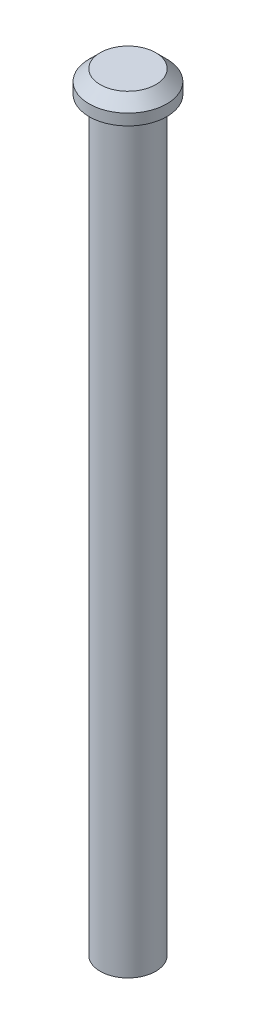
ISO-10303-21;
HEADER;
FILE_DESCRIPTION(('STEP AP214'),'2;1');
FILE_NAME('part.step','',(''),(''),'','','');
FILE_SCHEMA(('AUTOMOTIVE_DESIGN { 1 0 10303 214 1 1 1 1 }'));
ENDSEC;
DATA;
#1=APPLICATION_CONTEXT('core data for automotive mechanical design processes');
#2=APPLICATION_PROTOCOL_DEFINITION('international standard','automotive_design',2000,#1);
#3=PRODUCT_CONTEXT('',#1,'mechanical');
#4=PRODUCT('Part','Part','',(#3));
#5=PRODUCT_RELATED_PRODUCT_CATEGORY('part','',(#4));
#6=PRODUCT_DEFINITION_FORMATION('','',#4);
#7=PRODUCT_DEFINITION_CONTEXT('part definition',#1,'design');
#8=PRODUCT_DEFINITION('design','',#6,#7);
#9=PRODUCT_DEFINITION_SHAPE('','',#8);
#10=(LENGTH_UNIT() NAMED_UNIT(*) SI_UNIT(.MILLI.,.METRE.));
#11=(NAMED_UNIT(*) PLANE_ANGLE_UNIT() SI_UNIT($,.RADIAN.));
#12=(NAMED_UNIT(*) SI_UNIT($,.STERADIAN.) SOLID_ANGLE_UNIT());
#13=UNCERTAINTY_MEASURE_WITH_UNIT(LENGTH_MEASURE(1.E-05),#10,'distance_accuracy_value','');
#14=(GEOMETRIC_REPRESENTATION_CONTEXT(3) GLOBAL_UNCERTAINTY_ASSIGNED_CONTEXT((#13)) GLOBAL_UNIT_ASSIGNED_CONTEXT((#10,
#11,#12)) REPRESENTATION_CONTEXT('',''));
#15=CARTESIAN_POINT('',(0.,0.,0.));
#16=DIRECTION('',(0.,0.,1.));
#17=DIRECTION('',(1.,0.,0.));
#18=AXIS2_PLACEMENT_3D('',#15,#16,#17);
#19=CARTESIAN_POINT('',(0.,67.21,0.));
#20=DIRECTION('',(0.,-1.,0.));
#21=DIRECTION('',(0.,0.,-1.));
#22=AXIS2_PLACEMENT_3D('',#19,#20,#21);
#23=CYLINDRICAL_SURFACE('',#22,2.5);
#24=CARTESIAN_POINT('',(0.,67.21,0.));
#25=DIRECTION('',(0.,1.,0.));
#26=DIRECTION('',(0.,0.,1.));
#27=AXIS2_PLACEMENT_3D('',#24,#25,#26);
#28=CIRCLE('',#27,2.5);
#29=CARTESIAN_POINT('',(0.,67.21,2.5));
#30=VERTEX_POINT('',#29);
#31=EDGE_CURVE('E53',#30,#30,#28,.T.);
#32=ORIENTED_EDGE('',*,*,#31,.F.);
#33=EDGE_LOOP('',(#32));
#34=FACE_BOUND('',#33,.T.);
#35=CARTESIAN_POINT('',(0.,0.,0.));
#36=DIRECTION('',(0.,1.,0.));
#37=DIRECTION('',(0.,0.,1.));
#38=AXIS2_PLACEMENT_3D('',#35,#36,#37);
#39=CIRCLE('',#38,2.5);
#40=CARTESIAN_POINT('',(0.,0.,2.5));
#41=VERTEX_POINT('',#40);
#42=EDGE_CURVE('E58',#41,#41,#39,.T.);
#43=ORIENTED_EDGE('',*,*,#42,.T.);
#44=EDGE_LOOP('',(#43));
#45=FACE_BOUND('',#44,.T.);
#46=ADVANCED_FACE('F39',(#34,#45),#23,.T.);
#47=CARTESIAN_POINT('',(0.,0.,0.));
#48=DIRECTION('',(0.,1.,0.));
#49=DIRECTION('',(0.,0.,1.));
#50=AXIS2_PLACEMENT_3D('',#47,#48,#49);
#51=PLANE('',#50);
#52=CARTESIAN_POINT('',(0.,0.,0.));
#53=DIRECTION('',(0.,-1.,0.));
#54=DIRECTION('',(0.,0.,-1.));
#55=AXIS2_PLACEMENT_3D('',#52,#53,#54);
#56=CIRCLE('',#55,1.5);
#57=CARTESIAN_POINT('',(0.,0.,-1.5));
#58=VERTEX_POINT('',#57);
#59=EDGE_CURVE('E69',#58,#58,#56,.T.);
#60=ORIENTED_EDGE('',*,*,#59,.F.);
#61=EDGE_LOOP('',(#60));
#62=FACE_BOUND('',#61,.T.);
#63=ORIENTED_EDGE('',*,*,#42,.F.);
#64=EDGE_LOOP('',(#63));
#65=FACE_BOUND('',#64,.T.);
#66=ADVANCED_FACE('F85',(#62,#65),#51,.F.);
#67=CARTESIAN_POINT('',(0.,69.21,0.));
#68=DIRECTION('',(0.,-1.,0.));
#69=DIRECTION('',(0.,0.,-1.));
#70=AXIS2_PLACEMENT_3D('',#67,#68,#69);
#71=CYLINDRICAL_SURFACE('',#70,3.5);
#72=CARTESIAN_POINT('',(0.,68.21,0.));
#73=DIRECTION('',(0.,1.,0.));
#74=DIRECTION('',(0.,0.,1.));
#75=AXIS2_PLACEMENT_3D('',#72,#73,#74);
#76=CIRCLE('',#75,3.5);
#77=CARTESIAN_POINT('',(0.,68.21,3.5));
#78=VERTEX_POINT('',#77);
#79=EDGE_CURVE('E10',#78,#78,#76,.F.);
#80=ORIENTED_EDGE('',*,*,#79,.T.);
#81=EDGE_LOOP('',(#80));
#82=FACE_BOUND('',#81,.T.);
#83=CARTESIAN_POINT('',(0.,67.21,0.));
#84=DIRECTION('',(0.,1.,0.));
#85=DIRECTION('',(0.,0.,1.));
#86=AXIS2_PLACEMENT_3D('',#83,#84,#85);
#87=CIRCLE('',#86,3.5);
#88=CARTESIAN_POINT('',(0.,67.21,3.5));
#89=VERTEX_POINT('',#88);
#90=EDGE_CURVE('E63',#89,#89,#87,.T.);
#91=ORIENTED_EDGE('',*,*,#90,.T.);
#92=EDGE_LOOP('',(#91));
#93=FACE_BOUND('',#92,.T.);
#94=ADVANCED_FACE('F88',(#82,#93),#71,.T.);
#95=CARTESIAN_POINT('',(0.,69.21,0.));
#96=DIRECTION('',(0.,1.,0.));
#97=DIRECTION('',(0.,0.,1.));
#98=AXIS2_PLACEMENT_3D('',#95,#96,#97);
#99=PLANE('',#98);
#100=CARTESIAN_POINT('',(0.,69.21,0.));
#101=DIRECTION('',(0.,1.,0.));
#102=DIRECTION('',(0.,0.,1.));
#103=AXIS2_PLACEMENT_3D('',#100,#101,#102);
#104=CIRCLE('',#103,2.5);
#105=CARTESIAN_POINT('',(0.,69.21,2.5));
#106=VERTEX_POINT('',#105);
#107=EDGE_CURVE('E48',#106,#106,#104,.T.);
#108=ORIENTED_EDGE('',*,*,#107,.T.);
#109=EDGE_LOOP('',(#108));
#110=FACE_BOUND('',#109,.T.);
#111=ADVANCED_FACE('F100',(#110),#99,.T.);
#112=CARTESIAN_POINT('',(0.,67.21,0.));
#113=DIRECTION('',(0.,1.,0.));
#114=DIRECTION('',(0.,0.,1.));
#115=AXIS2_PLACEMENT_3D('',#112,#113,#114);
#116=PLANE('',#115);
#117=ORIENTED_EDGE('',*,*,#31,.T.);
#118=EDGE_LOOP('',(#117));
#119=FACE_BOUND('',#118,.T.);
#120=ORIENTED_EDGE('',*,*,#90,.F.);
#121=EDGE_LOOP('',(#120));
#122=FACE_BOUND('',#121,.T.);
#123=ADVANCED_FACE('F101',(#119,#122),#116,.F.);
#124=CARTESIAN_POINT('',(0.,69.21,0.));
#125=DIRECTION('',(0.,-1.,0.));
#126=DIRECTION('',(0.,0.,-1.));
#127=AXIS2_PLACEMENT_3D('',#124,#125,#126);
#128=CONICAL_SURFACE('',#127,2.5,0.78539816339744);
#129=ORIENTED_EDGE('',*,*,#79,.F.);
#130=EDGE_LOOP('',(#129));
#131=FACE_BOUND('',#130,.T.);
#132=ORIENTED_EDGE('',*,*,#107,.F.);
#133=EDGE_LOOP('',(#132));
#134=FACE_BOUND('',#133,.T.);
#135=ADVANCED_FACE('F42',(#131,#134),#128,.T.);
#136=CARTESIAN_POINT('',(0.,5.,0.));
#137=DIRECTION('',(0.,-1.,0.));
#138=DIRECTION('',(0.,0.,-1.));
#139=AXIS2_PLACEMENT_3D('',#136,#137,#138);
#140=CYLINDRICAL_SURFACE('',#139,1.5);
#141=CARTESIAN_POINT('',(0.,5.,0.));
#142=DIRECTION('',(0.,-1.,0.));
#143=DIRECTION('',(0.,0.,-1.));
#144=AXIS2_PLACEMENT_3D('',#141,#142,#143);
#145=CIRCLE('',#144,1.5);
#146=CARTESIAN_POINT('',(0.,5.,-1.5));
#147=VERTEX_POINT('',#146);
#148=EDGE_CURVE('E68',#147,#147,#145,.T.);
#149=ORIENTED_EDGE('',*,*,#148,.F.);
#150=EDGE_LOOP('',(#149));
#151=FACE_BOUND('',#150,.T.);
#152=ORIENTED_EDGE('',*,*,#59,.T.);
#153=EDGE_LOOP('',(#152));
#154=FACE_BOUND('',#153,.T.);
#155=ADVANCED_FACE('F79',(#151,#154),#140,.F.);
#156=CARTESIAN_POINT('',(0.,5.,0.));
#157=DIRECTION('',(0.,-1.,0.));
#158=DIRECTION('',(0.,0.,-1.));
#159=AXIS2_PLACEMENT_3D('',#156,#157,#158);
#160=PLANE('',#159);
#161=ORIENTED_EDGE('',*,*,#148,.T.);
#162=EDGE_LOOP('',(#161));
#163=FACE_BOUND('',#162,.T.);
#164=ADVANCED_FACE('F77',(#163),#160,.T.);
#165=CLOSED_SHELL('',(#46,#66,#94,#111,#123,#135,#155,#164));
#166=MANIFOLD_SOLID_BREP('B2',#165);
#167=ADVANCED_BREP_SHAPE_REPRESENTATION('',(#18,#166),#14);
#168=SHAPE_DEFINITION_REPRESENTATION(#9,#167);
ENDSEC;
END-ISO-10303-21;
